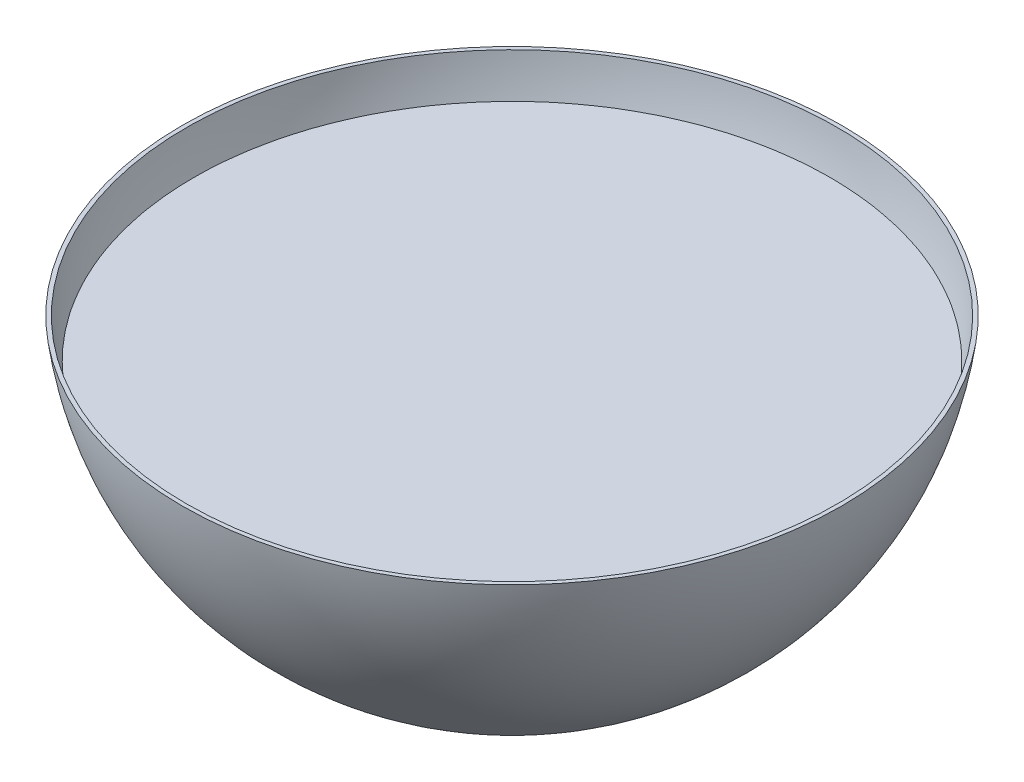
ISO-10303-21;
HEADER;
FILE_DESCRIPTION(('STEP AP214'),'2;1');
FILE_NAME('part.step','',(''),(''),'','','');
FILE_SCHEMA(('AUTOMOTIVE_DESIGN { 1 0 10303 214 1 1 1 1 }'));
ENDSEC;
DATA;
#1=APPLICATION_CONTEXT('core data for automotive mechanical design processes');
#2=APPLICATION_PROTOCOL_DEFINITION('international standard','automotive_design',2000,#1);
#3=PRODUCT_CONTEXT('',#1,'mechanical');
#4=PRODUCT('Part','Part','',(#3));
#5=PRODUCT_RELATED_PRODUCT_CATEGORY('part','',(#4));
#6=PRODUCT_DEFINITION_FORMATION('','',#4);
#7=PRODUCT_DEFINITION_CONTEXT('part definition',#1,'design');
#8=PRODUCT_DEFINITION('design','',#6,#7);
#9=PRODUCT_DEFINITION_SHAPE('','',#8);
#10=(LENGTH_UNIT() NAMED_UNIT(*) SI_UNIT(.MILLI.,.METRE.));
#11=(NAMED_UNIT(*) PLANE_ANGLE_UNIT() SI_UNIT($,.RADIAN.));
#12=(NAMED_UNIT(*) SI_UNIT($,.STERADIAN.) SOLID_ANGLE_UNIT());
#13=UNCERTAINTY_MEASURE_WITH_UNIT(LENGTH_MEASURE(1.E-05),#10,'distance_accuracy_value','');
#14=(GEOMETRIC_REPRESENTATION_CONTEXT(3) GLOBAL_UNCERTAINTY_ASSIGNED_CONTEXT((#13)) GLOBAL_UNIT_ASSIGNED_CONTEXT((#10,
#11,#12)) REPRESENTATION_CONTEXT('',''));
#15=CARTESIAN_POINT('',(0.,0.,0.));
#16=DIRECTION('',(0.,0.,1.));
#17=DIRECTION('',(1.,0.,0.));
#18=AXIS2_PLACEMENT_3D('',#15,#16,#17);
#19=CARTESIAN_POINT('',(0.,0.,0.));
#20=DIRECTION('',(0.,1.,0.));
#21=DIRECTION('',(0.,0.,1.));
#22=AXIS2_PLACEMENT_3D('',#19,#20,#21);
#23=PLANE('',#22);
#24=CARTESIAN_POINT('',(0.,0.,0.));
#25=DIRECTION('',(0.,1.,0.));
#26=DIRECTION('',(0.,0.,1.));
#27=AXIS2_PLACEMENT_3D('',#24,#25,#26);
#28=CIRCLE('',#27,82.8701637647615);
#29=CARTESIAN_POINT('',(0.,0.,82.8701637647615));
#30=VERTEX_POINT('',#29);
#31=EDGE_CURVE('E85',#30,#30,#28,.T.);
#32=ORIENTED_EDGE('',*,*,#31,.F.);
#33=EDGE_LOOP('',(#32));
#34=FACE_BOUND('',#33,.T.);
#35=CARTESIAN_POINT('',(0.,0.,0.));
#36=DIRECTION('',(0.,1.,0.));
#37=DIRECTION('',(0.,0.,1.));
#38=AXIS2_PLACEMENT_3D('',#35,#36,#37);
#39=CIRCLE('',#38,83.8784217568288);
#40=CARTESIAN_POINT('',(0.,0.,83.8784217568288));
#41=VERTEX_POINT('',#40);
#42=EDGE_CURVE('E13',#41,#41,#39,.T.);
#43=ORIENTED_EDGE('',*,*,#42,.T.);
#44=EDGE_LOOP('',(#43));
#45=FACE_BOUND('',#44,.T.);
#46=ADVANCED_FACE('F78',(#34,#45),#23,.T.);
#47=CARTESIAN_POINT('',(0.,10.6269214757642,0.852536767095686));
#48=DIRECTION('',(-1.,0.,0.));
#49=DIRECTION('',(0.,0.,1.));
#50=AXIS2_PLACEMENT_3D('',#47,#48,#49);
#51=CIRCLE('',#50,83.703220000072);
#52=TRIMMED_CURVE('',#51,(PARAMETER_VALUE(-1.58098173552824)),
(PARAMETER_VALUE(1.58098173552824)),.T.,.PARAMETER.);
#53=CARTESIAN_POINT('',(0.,10.6269214757642,0.));
#54=DIRECTION('',(0.,1.,0.));
#55=AXIS1_PLACEMENT('',#53,#54);
#56=SURFACE_OF_REVOLUTION('',#52,#55);
#57=CARTESIAN_POINT('',(0.,-73.0719567690557,0.));
#58=VERTEX_POINT('',#57);
#59=VERTEX_LOOP('',#58);
#60=FACE_BOUND('',#59,.T.);
#61=ORIENTED_EDGE('',*,*,#42,.F.);
#62=EDGE_LOOP('',(#61));
#63=FACE_BOUND('',#62,.T.);
#64=ADVANCED_FACE('F94',(#60,#63),#56,.T.);
#65=CARTESIAN_POINT('',(0.,10.6269214757642,0.852536767095686));
#66=DIRECTION('',(-1.,0.,0.));
#67=DIRECTION('',(0.,0.,1.));
#68=AXIS2_PLACEMENT_3D('',#65,#66,#67);
#69=CIRCLE('',#68,82.703220000072);
#70=TRIMMED_CURVE('',#69,(PARAMETER_VALUE(-1.58110489599747)),
(PARAMETER_VALUE(1.58110489599747)),.T.,.PARAMETER.);
#71=CARTESIAN_POINT('',(0.,10.6269214757642,0.));
#72=DIRECTION('',(0.,1.,0.));
#73=AXIS1_PLACEMENT('',#71,#72);
#74=SURFACE_OF_REVOLUTION('',#70,#73);
#75=CARTESIAN_POINT('',(0.,-72.0719042682634,0.));
#76=VERTEX_POINT('',#75);
#77=VERTEX_LOOP('',#76);
#78=FACE_BOUND('',#77,.T.);
#79=ORIENTED_EDGE('',*,*,#31,.T.);
#80=EDGE_LOOP('',(#79));
#81=FACE_BOUND('',#80,.T.);
#82=ADVANCED_FACE('F91',(#78,#81),#74,.F.);
#83=CLOSED_SHELL('',(#46,#64,#82));
#84=MANIFOLD_SOLID_BREP('B2',#83);
#85=CARTESIAN_POINT('',(0.,10.6269214757642,0.852536767095686));
#86=DIRECTION('',(-1.,0.,0.));
#87=DIRECTION('',(0.,0.,1.));
#88=AXIS2_PLACEMENT_3D('',#85,#86,#87);
#89=CIRCLE('',#88,82.703220000072);
#90=TRIMMED_CURVE('',#89,(PARAMETER_VALUE(-1.58110489599747)),
(PARAMETER_VALUE(1.58110489599747)),.T.,.PARAMETER.);
#91=CARTESIAN_POINT('',(0.,10.6269214757642,0.));
#92=DIRECTION('',(0.,1.,0.));
#93=AXIS1_PLACEMENT('',#91,#92);
#94=SURFACE_OF_REVOLUTION('',#90,#93);
#95=CARTESIAN_POINT('',(0.,-72.0719042682634,0.));
#96=VERTEX_POINT('',#95);
#97=VERTEX_LOOP('',#96);
#98=FACE_BOUND('',#97,.T.);
#99=CARTESIAN_POINT('',(0.,-10.,0.));
#100=DIRECTION('',(0.,1.,0.));
#101=DIRECTION('',(0.,0.,1.));
#102=AXIS2_PLACEMENT_3D('',#99,#100,#101);
#103=CIRCLE('',#102,80.9421909604617);
#104=CARTESIAN_POINT('',(0.,-10.,80.9421909604617));
#105=VERTEX_POINT('',#104);
#106=EDGE_CURVE('E76',#105,#105,#103,.F.);
#107=ORIENTED_EDGE('',*,*,#106,.T.);
#108=EDGE_LOOP('',(#107));
#109=FACE_BOUND('',#108,.T.);
#110=ADVANCED_FACE('F125',(#98,#109),#94,.T.);
#111=CARTESIAN_POINT('',(0.,-10.,0.));
#112=DIRECTION('',(0.,1.,0.));
#113=DIRECTION('',(0.,0.,1.));
#114=AXIS2_PLACEMENT_3D('',#111,#112,#113);
#115=PLANE('',#114);
#116=ORIENTED_EDGE('',*,*,#106,.F.);
#117=EDGE_LOOP('',(#116));
#118=FACE_BOUND('',#117,.T.);
#119=ADVANCED_FACE('F127',(#118),#115,.T.);
#120=CLOSED_SHELL('',(#110,#119));
#121=MANIFOLD_SOLID_BREP('B7',#120);
#122=ADVANCED_BREP_SHAPE_REPRESENTATION('',(#18,#84,#121),#14);
#123=SHAPE_DEFINITION_REPRESENTATION(#9,#122);
ENDSEC;
END-ISO-10303-21;
